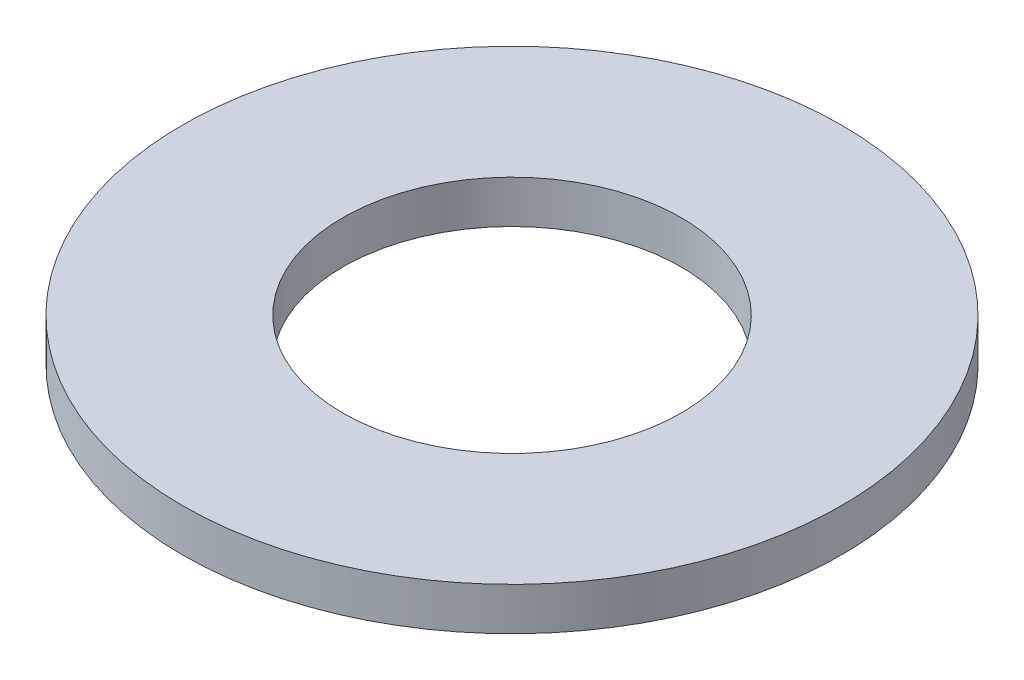
ISO-10303-21;
HEADER;
FILE_DESCRIPTION(('STEP AP214'),'2;1');
FILE_NAME('part.step','',(''),(''),'','','');
FILE_SCHEMA(('AUTOMOTIVE_DESIGN { 1 0 10303 214 1 1 1 1 }'));
ENDSEC;
DATA;
#1=APPLICATION_CONTEXT('core data for automotive mechanical design processes');
#2=APPLICATION_PROTOCOL_DEFINITION('international standard','automotive_design',2000,#1);
#3=PRODUCT_CONTEXT('',#1,'mechanical');
#4=PRODUCT('Part','Part','',(#3));
#5=PRODUCT_RELATED_PRODUCT_CATEGORY('part','',(#4));
#6=PRODUCT_DEFINITION_FORMATION('','',#4);
#7=PRODUCT_DEFINITION_CONTEXT('part definition',#1,'design');
#8=PRODUCT_DEFINITION('design','',#6,#7);
#9=PRODUCT_DEFINITION_SHAPE('','',#8);
#10=(LENGTH_UNIT() NAMED_UNIT(*) SI_UNIT(.MILLI.,.METRE.));
#11=(NAMED_UNIT(*) PLANE_ANGLE_UNIT() SI_UNIT($,.RADIAN.));
#12=(NAMED_UNIT(*) SI_UNIT($,.STERADIAN.) SOLID_ANGLE_UNIT());
#13=UNCERTAINTY_MEASURE_WITH_UNIT(LENGTH_MEASURE(1.E-05),#10,'distance_accuracy_value','');
#14=(GEOMETRIC_REPRESENTATION_CONTEXT(3) GLOBAL_UNCERTAINTY_ASSIGNED_CONTEXT((#13)) GLOBAL_UNIT_ASSIGNED_CONTEXT((#10,
#11,#12)) REPRESENTATION_CONTEXT('',''));
#15=CARTESIAN_POINT('',(0.,0.,0.));
#16=DIRECTION('',(0.,0.,1.));
#17=DIRECTION('',(1.,0.,0.));
#18=AXIS2_PLACEMENT_3D('',#15,#16,#17);
#19=CARTESIAN_POINT('',(0.,12.,0.));
#20=DIRECTION('',(0.,-1.,0.));
#21=DIRECTION('',(0.,0.,-1.));
#22=AXIS2_PLACEMENT_3D('',#19,#20,#21);
#23=CYLINDRICAL_SURFACE('',#22,92.5);
#24=CARTESIAN_POINT('',(0.,12.,0.));
#25=DIRECTION('',(0.,1.,0.));
#26=DIRECTION('',(0.,0.,1.));
#27=AXIS2_PLACEMENT_3D('',#24,#25,#26);
#28=CIRCLE('',#27,92.5);
#29=CARTESIAN_POINT('',(0.,12.,92.5));
#30=VERTEX_POINT('',#29);
#31=EDGE_CURVE('E10',#30,#30,#28,.T.);
#32=ORIENTED_EDGE('',*,*,#31,.F.);
#33=EDGE_LOOP('',(#32));
#34=FACE_BOUND('',#33,.T.);
#35=CARTESIAN_POINT('',(0.,0.,0.));
#36=DIRECTION('',(0.,1.,0.));
#37=DIRECTION('',(0.,0.,1.));
#38=AXIS2_PLACEMENT_3D('',#35,#36,#37);
#39=CIRCLE('',#38,92.5);
#40=CARTESIAN_POINT('',(0.,0.,92.5));
#41=VERTEX_POINT('',#40);
#42=EDGE_CURVE('E37',#41,#41,#39,.T.);
#43=ORIENTED_EDGE('',*,*,#42,.T.);
#44=EDGE_LOOP('',(#43));
#45=FACE_BOUND('',#44,.T.);
#46=ADVANCED_FACE('F40',(#34,#45),#23,.T.);
#47=CARTESIAN_POINT('',(0.,12.,0.));
#48=DIRECTION('',(0.,1.,0.));
#49=DIRECTION('',(0.,0.,1.));
#50=AXIS2_PLACEMENT_3D('',#47,#48,#49);
#51=PLANE('',#50);
#52=CARTESIAN_POINT('',(0.,12.,0.));
#53=DIRECTION('',(0.,1.,0.));
#54=DIRECTION('',(0.,0.,1.));
#55=AXIS2_PLACEMENT_3D('',#52,#53,#54);
#56=CIRCLE('',#55,47.5);
#57=CARTESIAN_POINT('',(0.,12.,47.5));
#58=VERTEX_POINT('',#57);
#59=EDGE_CURVE('E50',#58,#58,#56,.T.);
#60=ORIENTED_EDGE('',*,*,#59,.F.);
#61=EDGE_LOOP('',(#60));
#62=FACE_BOUND('',#61,.T.);
#63=ORIENTED_EDGE('',*,*,#31,.T.);
#64=EDGE_LOOP('',(#63));
#65=FACE_BOUND('',#64,.T.);
#66=ADVANCED_FACE('F59',(#62,#65),#51,.T.);
#67=CARTESIAN_POINT('',(0.,0.,0.));
#68=DIRECTION('',(0.,1.,0.));
#69=DIRECTION('',(0.,0.,1.));
#70=AXIS2_PLACEMENT_3D('',#67,#68,#69);
#71=PLANE('',#70);
#72=CARTESIAN_POINT('',(0.,0.,0.));
#73=DIRECTION('',(0.,1.,0.));
#74=DIRECTION('',(0.,0.,1.));
#75=AXIS2_PLACEMENT_3D('',#72,#73,#74);
#76=CIRCLE('',#75,47.5);
#77=CARTESIAN_POINT('',(0.,0.,47.5));
#78=VERTEX_POINT('',#77);
#79=EDGE_CURVE('E47',#78,#78,#76,.T.);
#80=ORIENTED_EDGE('',*,*,#79,.T.);
#81=EDGE_LOOP('',(#80));
#82=FACE_BOUND('',#81,.T.);
#83=ORIENTED_EDGE('',*,*,#42,.F.);
#84=EDGE_LOOP('',(#83));
#85=FACE_BOUND('',#84,.T.);
#86=ADVANCED_FACE('F58',(#82,#85),#71,.F.);
#87=CARTESIAN_POINT('',(0.,12.,0.));
#88=DIRECTION('',(0.,-1.,0.));
#89=DIRECTION('',(0.,0.,-1.));
#90=AXIS2_PLACEMENT_3D('',#87,#88,#89);
#91=CYLINDRICAL_SURFACE('',#90,47.5);
#92=ORIENTED_EDGE('',*,*,#59,.T.);
#93=EDGE_LOOP('',(#92));
#94=FACE_BOUND('',#93,.T.);
#95=ORIENTED_EDGE('',*,*,#79,.F.);
#96=EDGE_LOOP('',(#95));
#97=FACE_BOUND('',#96,.T.);
#98=ADVANCED_FACE('F54',(#94,#97),#91,.F.);
#99=CLOSED_SHELL('',(#46,#66,#86,#98));
#100=MANIFOLD_SOLID_BREP('B2',#99);
#101=ADVANCED_BREP_SHAPE_REPRESENTATION('',(#18,#100),#14);
#102=SHAPE_DEFINITION_REPRESENTATION(#9,#101);
ENDSEC;
END-ISO-10303-21;
